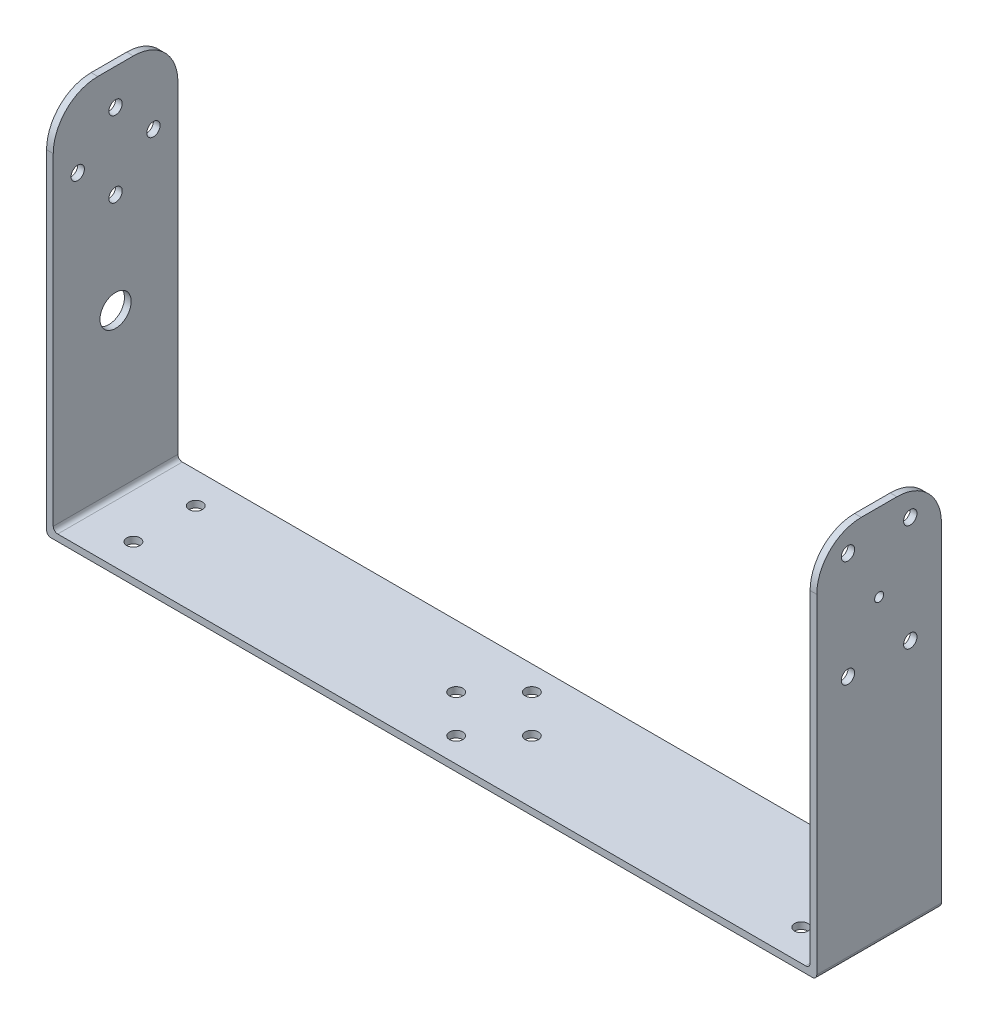
ISO-10303-21;
HEADER;
FILE_DESCRIPTION(('STEP AP214'),'2;1');
FILE_NAME('part.step','',(''),(''),'','','');
FILE_SCHEMA(('AUTOMOTIVE_DESIGN { 1 0 10303 214 1 1 1 1 }'));
ENDSEC;
DATA;
#1=APPLICATION_CONTEXT('core data for automotive mechanical design processes');
#2=APPLICATION_PROTOCOL_DEFINITION('international standard','automotive_design',2000,#1);
#3=PRODUCT_CONTEXT('',#1,'mechanical');
#4=PRODUCT('Part','Part','',(#3));
#5=PRODUCT_RELATED_PRODUCT_CATEGORY('part','',(#4));
#6=PRODUCT_DEFINITION_FORMATION('','',#4);
#7=PRODUCT_DEFINITION_CONTEXT('part definition',#1,'design');
#8=PRODUCT_DEFINITION('design','',#6,#7);
#9=PRODUCT_DEFINITION_SHAPE('','',#8);
#10=(LENGTH_UNIT() NAMED_UNIT(*) SI_UNIT(.MILLI.,.METRE.));
#11=(NAMED_UNIT(*) PLANE_ANGLE_UNIT() SI_UNIT($,.RADIAN.));
#12=(NAMED_UNIT(*) SI_UNIT($,.STERADIAN.) SOLID_ANGLE_UNIT());
#13=UNCERTAINTY_MEASURE_WITH_UNIT(LENGTH_MEASURE(1.E-05),#10,'distance_accuracy_value','');
#14=(GEOMETRIC_REPRESENTATION_CONTEXT(3) GLOBAL_UNCERTAINTY_ASSIGNED_CONTEXT((#13)) GLOBAL_UNIT_ASSIGNED_CONTEXT((#10,
#11,#12)) REPRESENTATION_CONTEXT('',''));
#15=CARTESIAN_POINT('',(0.,0.,0.));
#16=DIRECTION('',(0.,0.,1.));
#17=DIRECTION('',(1.,0.,0.));
#18=AXIS2_PLACEMENT_3D('',#15,#16,#17);
#19=CARTESIAN_POINT('',(0.,1.5,0.));
#20=DIRECTION('',(0.,-1.,0.));
#21=DIRECTION('',(0.,0.,-1.));
#22=AXIS2_PLACEMENT_3D('',#19,#20,#21);
#23=PLANE('',#22);
#24=CARTESIAN_POINT('',(93.5,1.5,-14.));
#25=DIRECTION('',(0.,-1.,0.));
#26=DIRECTION('',(0.,0.,-1.));
#27=AXIS2_PLACEMENT_3D('',#24,#25,#26);
#28=CIRCLE('',#27,1.5);
#29=CARTESIAN_POINT('',(93.5,1.5,-15.5));
#30=VERTEX_POINT('',#29);
#31=EDGE_CURVE('E302',#30,#30,#28,.F.);
#32=ORIENTED_EDGE('',*,*,#31,.F.);
#33=EDGE_LOOP('',(#32));
#34=FACE_BOUND('',#33,.T.);
#35=CARTESIAN_POINT('',(85.,1.5,-22.5));
#36=DIRECTION('',(0.,-1.,0.));
#37=DIRECTION('',(0.,0.,-1.));
#38=AXIS2_PLACEMENT_3D('',#35,#36,#37);
#39=CIRCLE('',#38,1.5);
#40=CARTESIAN_POINT('',(85.,1.5,-24.));
#41=VERTEX_POINT('',#40);
#42=EDGE_CURVE('E295',#41,#41,#39,.F.);
#43=ORIENTED_EDGE('',*,*,#42,.F.);
#44=EDGE_LOOP('',(#43));
#45=FACE_BOUND('',#44,.T.);
#46=CARTESIAN_POINT('',(11.,1.5,-7.));
#47=DIRECTION('',(0.,-1.,0.));
#48=DIRECTION('',(0.,0.,-1.));
#49=AXIS2_PLACEMENT_3D('',#46,#47,#48);
#50=CIRCLE('',#49,1.5);
#51=CARTESIAN_POINT('',(11.,1.5,-8.5));
#52=VERTEX_POINT('',#51);
#53=EDGE_CURVE('E244',#52,#52,#50,.F.);
#54=ORIENTED_EDGE('',*,*,#53,.F.);
#55=EDGE_LOOP('',(#54));
#56=FACE_BOUND('',#55,.T.);
#57=CARTESIAN_POINT('',(161.,1.5,-7.));
#58=DIRECTION('',(0.,-1.,0.));
#59=DIRECTION('',(0.,0.,-1.));
#60=AXIS2_PLACEMENT_3D('',#57,#58,#59);
#61=CIRCLE('',#60,1.5);
#62=CARTESIAN_POINT('',(161.,1.5,-8.5));
#63=VERTEX_POINT('',#62);
#64=EDGE_CURVE('E236',#63,#63,#61,.F.);
#65=ORIENTED_EDGE('',*,*,#64,.F.);
#66=EDGE_LOOP('',(#65));
#67=FACE_BOUND('',#66,.T.);
#68=DIRECTION('',(1.,0.,0.));
#69=VECTOR('',#68,1.);
#70=CARTESIAN_POINT('',(0.,1.5,0.));
#71=LINE('',#70,#69);
#72=CARTESIAN_POINT('',(1.,1.5,0.));
#73=VERTEX_POINT('',#72);
#74=CARTESIAN_POINT('',(169.,1.5,0.));
#75=VERTEX_POINT('',#74);
#76=EDGE_CURVE('E178',#73,#75,#71,.T.);
#77=ORIENTED_EDGE('',*,*,#76,.T.);
#78=DIRECTION('',(0.,0.,-1.));
#79=VECTOR('',#78,1.);
#80=CARTESIAN_POINT('',(169.,1.5,-28.));
#81=LINE('',#80,#79);
#82=CARTESIAN_POINT('',(169.,1.5,-28.));
#83=VERTEX_POINT('',#82);
#84=EDGE_CURVE('E343',#75,#83,#81,.T.);
#85=ORIENTED_EDGE('',*,*,#84,.T.);
#86=DIRECTION('',(-1.,0.,0.));
#87=VECTOR('',#86,1.);
#88=CARTESIAN_POINT('',(0.,1.5,-28.));
#89=LINE('',#88,#87);
#90=CARTESIAN_POINT('',(1.,1.5,-28.));
#91=VERTEX_POINT('',#90);
#92=EDGE_CURVE('E175',#83,#91,#89,.T.);
#93=ORIENTED_EDGE('',*,*,#92,.T.);
#94=DIRECTION('',(0.,0.,1.));
#95=VECTOR('',#94,1.);
#96=CARTESIAN_POINT('',(1.,1.5,0.));
#97=LINE('',#96,#95);
#98=EDGE_CURVE('E204',#91,#73,#97,.T.);
#99=ORIENTED_EDGE('',*,*,#98,.T.);
#100=EDGE_LOOP('',(#77,#85,#93,#99));
#101=FACE_BOUND('',#100,.T.);
#102=CARTESIAN_POINT('',(11.,1.5,-21.));
#103=DIRECTION('',(0.,-1.,0.));
#104=DIRECTION('',(0.,0.,-1.));
#105=AXIS2_PLACEMENT_3D('',#102,#103,#104);
#106=CIRCLE('',#105,1.5);
#107=CARTESIAN_POINT('',(11.,1.5,-22.5));
#108=VERTEX_POINT('',#107);
#109=EDGE_CURVE('E240',#108,#108,#106,.F.);
#110=ORIENTED_EDGE('',*,*,#109,.F.);
#111=EDGE_LOOP('',(#110));
#112=FACE_BOUND('',#111,.T.);
#113=CARTESIAN_POINT('',(161.,1.5,-21.));
#114=DIRECTION('',(0.,-1.,0.));
#115=DIRECTION('',(0.,0.,-1.));
#116=AXIS2_PLACEMENT_3D('',#113,#114,#115);
#117=CIRCLE('',#116,1.5);
#118=CARTESIAN_POINT('',(161.,1.5,-22.5));
#119=VERTEX_POINT('',#118);
#120=EDGE_CURVE('E248',#119,#119,#117,.F.);
#121=ORIENTED_EDGE('',*,*,#120,.F.);
#122=EDGE_LOOP('',(#121));
#123=FACE_BOUND('',#122,.T.);
#124=CARTESIAN_POINT('',(85.,1.5,-5.5));
#125=DIRECTION('',(0.,-1.,0.));
#126=DIRECTION('',(0.,0.,-1.));
#127=AXIS2_PLACEMENT_3D('',#124,#125,#126);
#128=CIRCLE('',#127,1.5);
#129=CARTESIAN_POINT('',(85.,1.5,-7.));
#130=VERTEX_POINT('',#129);
#131=EDGE_CURVE('E299',#130,#130,#128,.F.);
#132=ORIENTED_EDGE('',*,*,#131,.F.);
#133=EDGE_LOOP('',(#132));
#134=FACE_BOUND('',#133,.T.);
#135=CARTESIAN_POINT('',(76.5,1.5,-14.));
#136=DIRECTION('',(0.,-1.,0.));
#137=DIRECTION('',(0.,0.,-1.));
#138=AXIS2_PLACEMENT_3D('',#135,#136,#137);
#139=CIRCLE('',#138,1.5);
#140=CARTESIAN_POINT('',(76.5,1.5,-15.5));
#141=VERTEX_POINT('',#140);
#142=EDGE_CURVE('E305',#141,#141,#139,.F.);
#143=ORIENTED_EDGE('',*,*,#142,.F.);
#144=EDGE_LOOP('',(#143));
#145=FACE_BOUND('',#144,.T.);
#146=ADVANCED_FACE('F33',(#34,#45,#56,#67,#101,#112,#123,#134,#145),#23,.F.);
#147=CARTESIAN_POINT('',(0.,0.,0.));
#148=DIRECTION('',(0.,-1.,0.));
#149=DIRECTION('',(0.,0.,-1.));
#150=AXIS2_PLACEMENT_3D('',#147,#148,#149);
#151=PLANE('',#150);
#152=CARTESIAN_POINT('',(93.5,0.,-14.));
#153=DIRECTION('',(0.,-1.,0.));
#154=DIRECTION('',(0.,0.,-1.));
#155=AXIS2_PLACEMENT_3D('',#152,#153,#154);
#156=CIRCLE('',#155,1.5);
#157=CARTESIAN_POINT('',(93.5,0.,-15.5));
#158=VERTEX_POINT('',#157);
#159=EDGE_CURVE('E303',#158,#158,#156,.F.);
#160=ORIENTED_EDGE('',*,*,#159,.T.);
#161=EDGE_LOOP('',(#160));
#162=FACE_BOUND('',#161,.T.);
#163=CARTESIAN_POINT('',(85.,0.,-22.5));
#164=DIRECTION('',(0.,-1.,0.));
#165=DIRECTION('',(0.,0.,-1.));
#166=AXIS2_PLACEMENT_3D('',#163,#164,#165);
#167=CIRCLE('',#166,1.5);
#168=CARTESIAN_POINT('',(85.,0.,-24.));
#169=VERTEX_POINT('',#168);
#170=EDGE_CURVE('E296',#169,#169,#167,.F.);
#171=ORIENTED_EDGE('',*,*,#170,.T.);
#172=EDGE_LOOP('',(#171));
#173=FACE_BOUND('',#172,.T.);
#174=CARTESIAN_POINT('',(11.,0.,-7.));
#175=DIRECTION('',(0.,-1.,0.));
#176=DIRECTION('',(0.,0.,-1.));
#177=AXIS2_PLACEMENT_3D('',#174,#175,#176);
#178=CIRCLE('',#177,1.5);
#179=CARTESIAN_POINT('',(11.,0.,-8.5));
#180=VERTEX_POINT('',#179);
#181=EDGE_CURVE('E247',#180,#180,#178,.F.);
#182=ORIENTED_EDGE('',*,*,#181,.T.);
#183=EDGE_LOOP('',(#182));
#184=FACE_BOUND('',#183,.T.);
#185=CARTESIAN_POINT('',(161.,0.,-7.));
#186=DIRECTION('',(0.,-1.,0.));
#187=DIRECTION('',(0.,0.,-1.));
#188=AXIS2_PLACEMENT_3D('',#185,#186,#187);
#189=CIRCLE('',#188,1.5);
#190=CARTESIAN_POINT('',(161.,0.,-8.5));
#191=VERTEX_POINT('',#190);
#192=EDGE_CURVE('E239',#191,#191,#189,.F.);
#193=ORIENTED_EDGE('',*,*,#192,.T.);
#194=EDGE_LOOP('',(#193));
#195=FACE_BOUND('',#194,.T.);
#196=DIRECTION('',(-1.,0.,0.));
#197=VECTOR('',#196,1.);
#198=CARTESIAN_POINT('',(0.,0.,-28.));
#199=LINE('',#198,#197);
#200=CARTESIAN_POINT('',(170.5,0.,-28.));
#201=VERTEX_POINT('',#200);
#202=CARTESIAN_POINT('',(-0.5,0.,-28.));
#203=VERTEX_POINT('',#202);
#204=EDGE_CURVE('E195',#201,#203,#199,.T.);
#205=ORIENTED_EDGE('',*,*,#204,.F.);
#206=DIRECTION('',(0.,0.,-1.));
#207=VECTOR('',#206,1.);
#208=CARTESIAN_POINT('',(170.5,0.,0.));
#209=LINE('',#208,#207);
#210=CARTESIAN_POINT('',(170.5,0.,0.));
#211=VERTEX_POINT('',#210);
#212=EDGE_CURVE('E355',#201,#211,#209,.F.);
#213=ORIENTED_EDGE('',*,*,#212,.T.);
#214=DIRECTION('',(1.,0.,0.));
#215=VECTOR('',#214,1.);
#216=CARTESIAN_POINT('',(0.,0.,0.));
#217=LINE('',#216,#215);
#218=CARTESIAN_POINT('',(-0.5,0.,0.));
#219=VERTEX_POINT('',#218);
#220=EDGE_CURVE('E192',#219,#211,#217,.T.);
#221=ORIENTED_EDGE('',*,*,#220,.F.);
#222=DIRECTION('',(0.,0.,-1.));
#223=VECTOR('',#222,1.);
#224=CARTESIAN_POINT('',(-0.5,0.,-28.));
#225=LINE('',#224,#223);
#226=EDGE_CURVE('E377',#219,#203,#225,.T.);
#227=ORIENTED_EDGE('',*,*,#226,.T.);
#228=EDGE_LOOP('',(#205,#213,#221,#227));
#229=FACE_BOUND('',#228,.T.);
#230=CARTESIAN_POINT('',(11.,0.,-21.));
#231=DIRECTION('',(0.,-1.,0.));
#232=DIRECTION('',(0.,0.,-1.));
#233=AXIS2_PLACEMENT_3D('',#230,#231,#232);
#234=CIRCLE('',#233,1.5);
#235=CARTESIAN_POINT('',(11.,0.,-22.5));
#236=VERTEX_POINT('',#235);
#237=EDGE_CURVE('E243',#236,#236,#234,.F.);
#238=ORIENTED_EDGE('',*,*,#237,.T.);
#239=EDGE_LOOP('',(#238));
#240=FACE_BOUND('',#239,.T.);
#241=CARTESIAN_POINT('',(161.,0.,-21.));
#242=DIRECTION('',(0.,-1.,0.));
#243=DIRECTION('',(0.,0.,-1.));
#244=AXIS2_PLACEMENT_3D('',#241,#242,#243);
#245=CIRCLE('',#244,1.5);
#246=CARTESIAN_POINT('',(161.,0.,-22.5));
#247=VERTEX_POINT('',#246);
#248=EDGE_CURVE('E251',#247,#247,#245,.F.);
#249=ORIENTED_EDGE('',*,*,#248,.T.);
#250=EDGE_LOOP('',(#249));
#251=FACE_BOUND('',#250,.T.);
#252=CARTESIAN_POINT('',(85.,0.,-5.5));
#253=DIRECTION('',(0.,-1.,0.));
#254=DIRECTION('',(0.,0.,-1.));
#255=AXIS2_PLACEMENT_3D('',#252,#253,#254);
#256=CIRCLE('',#255,1.5);
#257=CARTESIAN_POINT('',(85.,0.,-7.));
#258=VERTEX_POINT('',#257);
#259=EDGE_CURVE('E300',#258,#258,#256,.F.);
#260=ORIENTED_EDGE('',*,*,#259,.T.);
#261=EDGE_LOOP('',(#260));
#262=FACE_BOUND('',#261,.T.);
#263=CARTESIAN_POINT('',(76.5,0.,-14.));
#264=DIRECTION('',(0.,-1.,0.));
#265=DIRECTION('',(0.,0.,-1.));
#266=AXIS2_PLACEMENT_3D('',#263,#264,#265);
#267=CIRCLE('',#266,1.5);
#268=CARTESIAN_POINT('',(76.5,0.,-15.5));
#269=VERTEX_POINT('',#268);
#270=EDGE_CURVE('E37',#269,#269,#267,.F.);
#271=ORIENTED_EDGE('',*,*,#270,.T.);
#272=EDGE_LOOP('',(#271));
#273=FACE_BOUND('',#272,.T.);
#274=ADVANCED_FACE('F374',(#162,#173,#184,#195,#229,#240,#251,#262,#273),#151,.T.);
#275=CARTESIAN_POINT('',(171.5,0.,0.));
#276=DIRECTION('',(1.,0.,0.));
#277=DIRECTION('',(0.,0.,-1.));
#278=AXIS2_PLACEMENT_3D('',#275,#276,#277);
#279=PLANE('',#278);
#280=CARTESIAN_POINT('',(171.5,55.5,-7.));
#281=DIRECTION('',(1.,0.,0.));
#282=DIRECTION('',(0.,0.,-1.));
#283=AXIS2_PLACEMENT_3D('',#280,#281,#282);
#284=CIRCLE('',#283,1.5);
#285=CARTESIAN_POINT('',(171.5,55.5,-8.5));
#286=VERTEX_POINT('',#285);
#287=EDGE_CURVE('E287',#286,#286,#284,.F.);
#288=ORIENTED_EDGE('',*,*,#287,.T.);
#289=EDGE_LOOP('',(#288));
#290=FACE_BOUND('',#289,.T.);
#291=CARTESIAN_POINT('',(171.5,79.5,-21.));
#292=DIRECTION('',(1.,0.,0.));
#293=DIRECTION('',(0.,0.,-1.));
#294=AXIS2_PLACEMENT_3D('',#291,#292,#293);
#295=CIRCLE('',#294,1.5);
#296=CARTESIAN_POINT('',(171.5,79.5,-22.5));
#297=VERTEX_POINT('',#296);
#298=EDGE_CURVE('E282',#297,#297,#295,.F.);
#299=ORIENTED_EDGE('',*,*,#298,.T.);
#300=EDGE_LOOP('',(#299));
#301=FACE_BOUND('',#300,.T.);
#302=DIRECTION('',(0.,1.,0.));
#303=VECTOR('',#302,1.);
#304=CARTESIAN_POINT('',(171.5,0.,-28.));
#305=LINE('',#304,#303);
#306=CARTESIAN_POINT('',(171.5,1.,-28.));
#307=VERTEX_POINT('',#306);
#308=CARTESIAN_POINT('',(171.5,75.,-28.));
#309=VERTEX_POINT('',#308);
#310=EDGE_CURVE('E260',#307,#309,#305,.T.);
#311=ORIENTED_EDGE('',*,*,#310,.T.);
#312=CARTESIAN_POINT('',(171.5,75.,-18.));
#313=DIRECTION('',(1.,0.,0.));
#314=DIRECTION('',(0.,0.,-1.));
#315=AXIS2_PLACEMENT_3D('',#312,#313,#314);
#316=CIRCLE('',#315,10.);
#317=CARTESIAN_POINT('',(171.5,85.,-18.));
#318=VERTEX_POINT('',#317);
#319=EDGE_CURVE('E11',#309,#318,#316,.T.);
#320=ORIENTED_EDGE('',*,*,#319,.T.);
#321=DIRECTION('',(0.,0.,1.));
#322=VECTOR('',#321,1.);
#323=CARTESIAN_POINT('',(171.5,85.,-28.));
#324=LINE('',#323,#322);
#325=CARTESIAN_POINT('',(171.5,85.,-10.));
#326=VERTEX_POINT('',#325);
#327=EDGE_CURVE('E336',#318,#326,#324,.T.);
#328=ORIENTED_EDGE('',*,*,#327,.T.);
#329=CARTESIAN_POINT('',(171.5,75.,-10.));
#330=DIRECTION('',(1.,0.,0.));
#331=DIRECTION('',(0.,0.,-1.));
#332=AXIS2_PLACEMENT_3D('',#329,#330,#331);
#333=CIRCLE('',#332,10.);
#334=CARTESIAN_POINT('',(171.5,75.,0.));
#335=VERTEX_POINT('',#334);
#336=EDGE_CURVE('E272',#326,#335,#333,.T.);
#337=ORIENTED_EDGE('',*,*,#336,.T.);
#338=DIRECTION('',(0.,-1.,0.));
#339=VECTOR('',#338,1.);
#340=CARTESIAN_POINT('',(171.5,0.,0.));
#341=LINE('',#340,#339);
#342=CARTESIAN_POINT('',(171.5,1.,0.));
#343=VERTEX_POINT('',#342);
#344=EDGE_CURVE('E338',#335,#343,#341,.T.);
#345=ORIENTED_EDGE('',*,*,#344,.T.);
#346=DIRECTION('',(0.,0.,-1.));
#347=VECTOR('',#346,1.);
#348=CARTESIAN_POINT('',(171.5,1.,0.));
#349=LINE('',#348,#347);
#350=EDGE_CURVE('E351',#343,#307,#349,.T.);
#351=ORIENTED_EDGE('',*,*,#350,.T.);
#352=EDGE_LOOP('',(#311,#320,#328,#337,#345,#351));
#353=FACE_BOUND('',#352,.T.);
#354=CARTESIAN_POINT('',(171.5,67.5,-14.));
#355=DIRECTION('',(1.,0.,0.));
#356=DIRECTION('',(0.,0.,-1.));
#357=AXIS2_PLACEMENT_3D('',#354,#355,#356);
#358=CIRCLE('',#357,1.);
#359=CARTESIAN_POINT('',(171.5,67.5,-15.));
#360=VERTEX_POINT('',#359);
#361=EDGE_CURVE('E329',#360,#360,#358,.T.);
#362=ORIENTED_EDGE('',*,*,#361,.F.);
#363=EDGE_LOOP('',(#362));
#364=FACE_BOUND('',#363,.T.);
#365=CARTESIAN_POINT('',(171.5,79.5,-7.));
#366=DIRECTION('',(1.,0.,0.));
#367=DIRECTION('',(0.,0.,-1.));
#368=AXIS2_PLACEMENT_3D('',#365,#366,#367);
#369=CIRCLE('',#368,1.5);
#370=CARTESIAN_POINT('',(171.5,79.5,-8.5));
#371=VERTEX_POINT('',#370);
#372=EDGE_CURVE('E283',#371,#371,#369,.F.);
#373=ORIENTED_EDGE('',*,*,#372,.T.);
#374=EDGE_LOOP('',(#373));
#375=FACE_BOUND('',#374,.T.);
#376=CARTESIAN_POINT('',(171.5,55.5,-21.));
#377=DIRECTION('',(1.,0.,0.));
#378=DIRECTION('',(0.,0.,-1.));
#379=AXIS2_PLACEMENT_3D('',#376,#377,#378);
#380=CIRCLE('',#379,1.5);
#381=CARTESIAN_POINT('',(171.5,55.5,-22.5));
#382=VERTEX_POINT('',#381);
#383=EDGE_CURVE('E291',#382,#382,#380,.F.);
#384=ORIENTED_EDGE('',*,*,#383,.T.);
#385=EDGE_LOOP('',(#384));
#386=FACE_BOUND('',#385,.T.);
#387=ADVANCED_FACE('F370',(#290,#301,#353,#364,#375,#386),#279,.T.);
#388=CARTESIAN_POINT('',(170.,0.,0.));
#389=DIRECTION('',(1.,0.,0.));
#390=DIRECTION('',(0.,0.,-1.));
#391=AXIS2_PLACEMENT_3D('',#388,#389,#390);
#392=PLANE('',#391);
#393=CARTESIAN_POINT('',(170.,55.5,-7.));
#394=DIRECTION('',(1.,0.,0.));
#395=DIRECTION('',(0.,0.,-1.));
#396=AXIS2_PLACEMENT_3D('',#393,#394,#395);
#397=CIRCLE('',#396,1.5);
#398=CARTESIAN_POINT('',(170.,55.5,-8.5));
#399=VERTEX_POINT('',#398);
#400=EDGE_CURVE('E288',#399,#399,#397,.F.);
#401=ORIENTED_EDGE('',*,*,#400,.F.);
#402=EDGE_LOOP('',(#401));
#403=FACE_BOUND('',#402,.T.);
#404=CARTESIAN_POINT('',(170.,79.5,-21.));
#405=DIRECTION('',(1.,0.,0.));
#406=DIRECTION('',(0.,0.,-1.));
#407=AXIS2_PLACEMENT_3D('',#404,#405,#406);
#408=CIRCLE('',#407,1.5);
#409=CARTESIAN_POINT('',(170.,79.5,-22.5));
#410=VERTEX_POINT('',#409);
#411=EDGE_CURVE('E279',#410,#410,#408,.F.);
#412=ORIENTED_EDGE('',*,*,#411,.F.);
#413=EDGE_LOOP('',(#412));
#414=FACE_BOUND('',#413,.T.);
#415=DIRECTION('',(0.,0.,1.));
#416=VECTOR('',#415,1.);
#417=CARTESIAN_POINT('',(170.,85.,-28.));
#418=LINE('',#417,#416);
#419=CARTESIAN_POINT('',(170.,85.,-18.));
#420=VERTEX_POINT('',#419);
#421=CARTESIAN_POINT('',(170.,85.,-10.));
#422=VERTEX_POINT('',#421);
#423=EDGE_CURVE('E254',#420,#422,#418,.T.);
#424=ORIENTED_EDGE('',*,*,#423,.F.);
#425=CARTESIAN_POINT('',(170.,75.,-18.));
#426=DIRECTION('',(1.,0.,0.));
#427=DIRECTION('',(0.,0.,-1.));
#428=AXIS2_PLACEMENT_3D('',#425,#426,#427);
#429=CIRCLE('',#428,10.);
#430=CARTESIAN_POINT('',(170.,75.,-28.));
#431=VERTEX_POINT('',#430);
#432=EDGE_CURVE('E57',#420,#431,#429,.F.);
#433=ORIENTED_EDGE('',*,*,#432,.T.);
#434=DIRECTION('',(0.,1.,0.));
#435=VECTOR('',#434,1.);
#436=CARTESIAN_POINT('',(170.,0.,-28.));
#437=LINE('',#436,#435);
#438=CARTESIAN_POINT('',(170.,2.5,-28.));
#439=VERTEX_POINT('',#438);
#440=EDGE_CURVE('E332',#439,#431,#437,.T.);
#441=ORIENTED_EDGE('',*,*,#440,.F.);
#442=DIRECTION('',(0.,0.,-1.));
#443=VECTOR('',#442,1.);
#444=CARTESIAN_POINT('',(170.,2.5,0.));
#445=LINE('',#444,#443);
#446=CARTESIAN_POINT('',(170.,2.5,0.));
#447=VERTEX_POINT('',#446);
#448=EDGE_CURVE('E344',#439,#447,#445,.F.);
#449=ORIENTED_EDGE('',*,*,#448,.T.);
#450=DIRECTION('',(0.,-1.,0.));
#451=VECTOR('',#450,1.);
#452=CARTESIAN_POINT('',(170.,0.,0.));
#453=LINE('',#452,#451);
#454=CARTESIAN_POINT('',(170.,75.,0.));
#455=VERTEX_POINT('',#454);
#456=EDGE_CURVE('E257',#455,#447,#453,.T.);
#457=ORIENTED_EDGE('',*,*,#456,.F.);
#458=CARTESIAN_POINT('',(170.,75.,-10.));
#459=DIRECTION('',(1.,0.,0.));
#460=DIRECTION('',(0.,0.,-1.));
#461=AXIS2_PLACEMENT_3D('',#458,#459,#460);
#462=CIRCLE('',#461,10.);
#463=EDGE_CURVE('E266',#455,#422,#462,.F.);
#464=ORIENTED_EDGE('',*,*,#463,.T.);
#465=EDGE_LOOP('',(#424,#433,#441,#449,#457,#464));
#466=FACE_BOUND('',#465,.T.);
#467=CARTESIAN_POINT('',(170.,67.5,-14.));
#468=DIRECTION('',(1.,0.,0.));
#469=DIRECTION('',(0.,0.,-1.));
#470=AXIS2_PLACEMENT_3D('',#467,#468,#469);
#471=CIRCLE('',#470,1.);
#472=CARTESIAN_POINT('',(170.,67.5,-15.));
#473=VERTEX_POINT('',#472);
#474=EDGE_CURVE('E328',#473,#473,#471,.T.);
#475=ORIENTED_EDGE('',*,*,#474,.T.);
#476=EDGE_LOOP('',(#475));
#477=FACE_BOUND('',#476,.T.);
#478=CARTESIAN_POINT('',(170.,79.5,-7.));
#479=DIRECTION('',(1.,0.,0.));
#480=DIRECTION('',(0.,0.,-1.));
#481=AXIS2_PLACEMENT_3D('',#478,#479,#480);
#482=CIRCLE('',#481,1.5);
#483=CARTESIAN_POINT('',(170.,79.5,-8.5));
#484=VERTEX_POINT('',#483);
#485=EDGE_CURVE('E284',#484,#484,#482,.F.);
#486=ORIENTED_EDGE('',*,*,#485,.F.);
#487=EDGE_LOOP('',(#486));
#488=FACE_BOUND('',#487,.T.);
#489=CARTESIAN_POINT('',(170.,55.5,-21.));
#490=DIRECTION('',(1.,0.,0.));
#491=DIRECTION('',(0.,0.,-1.));
#492=AXIS2_PLACEMENT_3D('',#489,#490,#491);
#493=CIRCLE('',#492,1.5);
#494=CARTESIAN_POINT('',(170.,55.5,-22.5));
#495=VERTEX_POINT('',#494);
#496=EDGE_CURVE('E292',#495,#495,#493,.F.);
#497=ORIENTED_EDGE('',*,*,#496,.F.);
#498=EDGE_LOOP('',(#497));
#499=FACE_BOUND('',#498,.T.);
#500=ADVANCED_FACE('F520',(#403,#414,#466,#477,#488,#499),#392,.F.);
#501=CARTESIAN_POINT('',(0.,0.,0.));
#502=DIRECTION('',(1.,0.,0.));
#503=DIRECTION('',(0.,0.,-1.));
#504=AXIS2_PLACEMENT_3D('',#501,#502,#503);
#505=PLANE('',#504);
#506=CARTESIAN_POINT('',(0.,68.5,-5.5));
#507=DIRECTION('',(1.,0.,0.));
#508=DIRECTION('',(0.,0.,-1.));
#509=AXIS2_PLACEMENT_3D('',#506,#507,#508);
#510=CIRCLE('',#509,1.5);
#511=CARTESIAN_POINT('',(0.,68.5,-7.));
#512=VERTEX_POINT('',#511);
#513=EDGE_CURVE('E228',#512,#512,#510,.F.);
#514=ORIENTED_EDGE('',*,*,#513,.T.);
#515=EDGE_LOOP('',(#514));
#516=FACE_BOUND('',#515,.T.);
#517=CARTESIAN_POINT('',(0.,60.,-14.));
#518=DIRECTION('',(1.,0.,0.));
#519=DIRECTION('',(0.,0.,-1.));
#520=AXIS2_PLACEMENT_3D('',#517,#518,#519);
#521=CIRCLE('',#520,1.5);
#522=CARTESIAN_POINT('',(0.,60.,-15.5));
#523=VERTEX_POINT('',#522);
#524=EDGE_CURVE('E220',#523,#523,#521,.F.);
#525=ORIENTED_EDGE('',*,*,#524,.T.);
#526=EDGE_LOOP('',(#525));
#527=FACE_BOUND('',#526,.T.);
#528=DIRECTION('',(0.,-1.,0.));
#529=VECTOR('',#528,1.);
#530=CARTESIAN_POINT('',(0.,0.,0.));
#531=LINE('',#530,#529);
#532=CARTESIAN_POINT('',(0.,75.,0.));
#533=VERTEX_POINT('',#532);
#534=CARTESIAN_POINT('',(0.,2.5,0.));
#535=VERTEX_POINT('',#534);
#536=EDGE_CURVE('E158',#533,#535,#531,.T.);
#537=ORIENTED_EDGE('',*,*,#536,.T.);
#538=DIRECTION('',(0.,0.,1.));
#539=VECTOR('',#538,1.);
#540=CARTESIAN_POINT('',(0.,2.5,0.));
#541=LINE('',#540,#539);
#542=CARTESIAN_POINT('',(0.,2.5,-28.));
#543=VERTEX_POINT('',#542);
#544=EDGE_CURVE('E207',#535,#543,#541,.F.);
#545=ORIENTED_EDGE('',*,*,#544,.T.);
#546=DIRECTION('',(0.,1.,0.));
#547=VECTOR('',#546,1.);
#548=CARTESIAN_POINT('',(0.,0.,-28.));
#549=LINE('',#548,#547);
#550=CARTESIAN_POINT('',(0.,75.,-28.));
#551=VERTEX_POINT('',#550);
#552=EDGE_CURVE('E208',#543,#551,#549,.T.);
#553=ORIENTED_EDGE('',*,*,#552,.T.);
#554=CARTESIAN_POINT('',(0.,75.,-18.));
#555=DIRECTION('',(1.,0.,0.));
#556=DIRECTION('',(0.,0.,-1.));
#557=AXIS2_PLACEMENT_3D('',#554,#555,#556);
#558=CIRCLE('',#557,10.);
#559=CARTESIAN_POINT('',(0.,85.,-18.));
#560=VERTEX_POINT('',#559);
#561=EDGE_CURVE('E173',#551,#560,#558,.T.);
#562=ORIENTED_EDGE('',*,*,#561,.T.);
#563=DIRECTION('',(0.,0.,1.));
#564=VECTOR('',#563,1.);
#565=CARTESIAN_POINT('',(0.,85.,-28.));
#566=LINE('',#565,#564);
#567=CARTESIAN_POINT('',(0.,85.,-10.));
#568=VERTEX_POINT('',#567);
#569=EDGE_CURVE('E186',#560,#568,#566,.T.);
#570=ORIENTED_EDGE('',*,*,#569,.T.);
#571=CARTESIAN_POINT('',(0.,75.,-10.));
#572=DIRECTION('',(1.,0.,0.));
#573=DIRECTION('',(0.,0.,-1.));
#574=AXIS2_PLACEMENT_3D('',#571,#572,#573);
#575=CIRCLE('',#574,10.);
#576=EDGE_CURVE('E174',#568,#533,#575,.T.);
#577=ORIENTED_EDGE('',*,*,#576,.T.);
#578=EDGE_LOOP('',(#537,#545,#553,#562,#570,#577));
#579=FACE_BOUND('',#578,.T.);
#580=CARTESIAN_POINT('',(0.,77.,-14.));
#581=DIRECTION('',(1.,0.,0.));
#582=DIRECTION('',(0.,0.,-1.));
#583=AXIS2_PLACEMENT_3D('',#580,#581,#582);
#584=CIRCLE('',#583,1.5);
#585=CARTESIAN_POINT('',(0.,77.,-15.5));
#586=VERTEX_POINT('',#585);
#587=EDGE_CURVE('E210',#586,#586,#584,.F.);
#588=ORIENTED_EDGE('',*,*,#587,.T.);
#589=EDGE_LOOP('',(#588));
#590=FACE_BOUND('',#589,.T.);
#591=CARTESIAN_POINT('',(0.,68.5,-22.5));
#592=DIRECTION('',(1.,0.,0.));
#593=DIRECTION('',(0.,0.,-1.));
#594=AXIS2_PLACEMENT_3D('',#591,#592,#593);
#595=CIRCLE('',#594,1.5);
#596=CARTESIAN_POINT('',(0.,68.5,-24.));
#597=VERTEX_POINT('',#596);
#598=EDGE_CURVE('E224',#597,#597,#595,.F.);
#599=ORIENTED_EDGE('',*,*,#598,.T.);
#600=EDGE_LOOP('',(#599));
#601=FACE_BOUND('',#600,.T.);
#602=CARTESIAN_POINT('',(0.,37.5,-14.));
#603=DIRECTION('',(1.,0.,0.));
#604=DIRECTION('',(0.,0.,-1.));
#605=AXIS2_PLACEMENT_3D('',#602,#603,#604);
#606=CIRCLE('',#605,3.5);
#607=CARTESIAN_POINT('',(0.,37.5,-17.5));
#608=VERTEX_POINT('',#607);
#609=EDGE_CURVE('E232',#608,#608,#606,.F.);
#610=ORIENTED_EDGE('',*,*,#609,.T.);
#611=EDGE_LOOP('',(#610));
#612=FACE_BOUND('',#611,.T.);
#613=ADVANCED_FACE('F434',(#516,#527,#579,#590,#601,#612),#505,.T.);
#614=CARTESIAN_POINT('',(-1.5,0.,0.));
#615=DIRECTION('',(1.,0.,0.));
#616=DIRECTION('',(0.,0.,-1.));
#617=AXIS2_PLACEMENT_3D('',#614,#615,#616);
#618=PLANE('',#617);
#619=CARTESIAN_POINT('',(-1.5,68.5,-5.5));
#620=DIRECTION('',(1.,0.,0.));
#621=DIRECTION('',(0.,0.,-1.));
#622=AXIS2_PLACEMENT_3D('',#619,#620,#621);
#623=CIRCLE('',#622,1.5);
#624=CARTESIAN_POINT('',(-1.5,68.5,-7.));
#625=VERTEX_POINT('',#624);
#626=EDGE_CURVE('E231',#625,#625,#623,.F.);
#627=ORIENTED_EDGE('',*,*,#626,.F.);
#628=EDGE_LOOP('',(#627));
#629=FACE_BOUND('',#628,.T.);
#630=CARTESIAN_POINT('',(-1.5,60.,-14.));
#631=DIRECTION('',(1.,0.,0.));
#632=DIRECTION('',(0.,0.,-1.));
#633=AXIS2_PLACEMENT_3D('',#630,#631,#632);
#634=CIRCLE('',#633,1.5);
#635=CARTESIAN_POINT('',(-1.5,60.,-15.5));
#636=VERTEX_POINT('',#635);
#637=EDGE_CURVE('E223',#636,#636,#634,.F.);
#638=ORIENTED_EDGE('',*,*,#637,.F.);
#639=EDGE_LOOP('',(#638));
#640=FACE_BOUND('',#639,.T.);
#641=DIRECTION('',(0.,1.,0.));
#642=VECTOR('',#641,1.);
#643=CARTESIAN_POINT('',(-1.5,0.,-28.));
#644=LINE('',#643,#642);
#645=CARTESIAN_POINT('',(-1.5,1.,-28.));
#646=VERTEX_POINT('',#645);
#647=CARTESIAN_POINT('',(-1.5,75.,-28.));
#648=VERTEX_POINT('',#647);
#649=EDGE_CURVE('E147',#646,#648,#644,.T.);
#650=ORIENTED_EDGE('',*,*,#649,.F.);
#651=DIRECTION('',(0.,0.,-1.));
#652=VECTOR('',#651,1.);
#653=CARTESIAN_POINT('',(-1.5,1.,0.));
#654=LINE('',#653,#652);
#655=CARTESIAN_POINT('',(-1.5,1.,0.));
#656=VERTEX_POINT('',#655);
#657=EDGE_CURVE('E381',#646,#656,#654,.F.);
#658=ORIENTED_EDGE('',*,*,#657,.T.);
#659=DIRECTION('',(0.,-1.,0.));
#660=VECTOR('',#659,1.);
#661=CARTESIAN_POINT('',(-1.5,0.,0.));
#662=LINE('',#661,#660);
#663=CARTESIAN_POINT('',(-1.5,75.,0.));
#664=VERTEX_POINT('',#663);
#665=EDGE_CURVE('E196',#664,#656,#662,.T.);
#666=ORIENTED_EDGE('',*,*,#665,.F.);
#667=CARTESIAN_POINT('',(-1.5,75.,-10.));
#668=DIRECTION('',(1.,0.,0.));
#669=DIRECTION('',(0.,0.,-1.));
#670=AXIS2_PLACEMENT_3D('',#667,#668,#669);
#671=CIRCLE('',#670,10.);
#672=CARTESIAN_POINT('',(-1.5,85.,-10.));
#673=VERTEX_POINT('',#672);
#674=EDGE_CURVE('E169',#664,#673,#671,.F.);
#675=ORIENTED_EDGE('',*,*,#674,.T.);
#676=DIRECTION('',(0.,0.,1.));
#677=VECTOR('',#676,1.);
#678=CARTESIAN_POINT('',(-1.5,85.,-28.));
#679=LINE('',#678,#677);
#680=CARTESIAN_POINT('',(-1.5,85.,-18.));
#681=VERTEX_POINT('',#680);
#682=EDGE_CURVE('E157',#681,#673,#679,.T.);
#683=ORIENTED_EDGE('',*,*,#682,.F.);
#684=CARTESIAN_POINT('',(-1.5,75.,-18.));
#685=DIRECTION('',(1.,0.,0.));
#686=DIRECTION('',(0.,0.,-1.));
#687=AXIS2_PLACEMENT_3D('',#684,#685,#686);
#688=CIRCLE('',#687,10.);
#689=EDGE_CURVE('E162',#681,#648,#688,.F.);
#690=ORIENTED_EDGE('',*,*,#689,.T.);
#691=EDGE_LOOP('',(#650,#658,#666,#675,#683,#690));
#692=FACE_BOUND('',#691,.T.);
#693=CARTESIAN_POINT('',(-1.5,77.,-14.));
#694=DIRECTION('',(1.,0.,0.));
#695=DIRECTION('',(0.,0.,-1.));
#696=AXIS2_PLACEMENT_3D('',#693,#694,#695);
#697=CIRCLE('',#696,1.5);
#698=CARTESIAN_POINT('',(-1.5,77.,-15.5));
#699=VERTEX_POINT('',#698);
#700=EDGE_CURVE('E219',#699,#699,#697,.F.);
#701=ORIENTED_EDGE('',*,*,#700,.F.);
#702=EDGE_LOOP('',(#701));
#703=FACE_BOUND('',#702,.T.);
#704=CARTESIAN_POINT('',(-1.5,68.5,-22.5));
#705=DIRECTION('',(1.,0.,0.));
#706=DIRECTION('',(0.,0.,-1.));
#707=AXIS2_PLACEMENT_3D('',#704,#705,#706);
#708=CIRCLE('',#707,1.5);
#709=CARTESIAN_POINT('',(-1.5,68.5,-24.));
#710=VERTEX_POINT('',#709);
#711=EDGE_CURVE('E227',#710,#710,#708,.F.);
#712=ORIENTED_EDGE('',*,*,#711,.F.);
#713=EDGE_LOOP('',(#712));
#714=FACE_BOUND('',#713,.T.);
#715=CARTESIAN_POINT('',(-1.5,37.5,-14.));
#716=DIRECTION('',(1.,0.,0.));
#717=DIRECTION('',(0.,0.,-1.));
#718=AXIS2_PLACEMENT_3D('',#715,#716,#717);
#719=CIRCLE('',#718,3.5);
#720=CARTESIAN_POINT('',(-1.5,37.5,-17.5));
#721=VERTEX_POINT('',#720);
#722=EDGE_CURVE('E235',#721,#721,#719,.F.);
#723=ORIENTED_EDGE('',*,*,#722,.F.);
#724=EDGE_LOOP('',(#723));
#725=FACE_BOUND('',#724,.T.);
#726=ADVANCED_FACE('F163',(#629,#640,#692,#703,#714,#725),#618,.F.);
#727=CARTESIAN_POINT('',(0.,1.5,0.));
#728=DIRECTION('',(0.,0.,-1.));
#729=DIRECTION('',(-1.,0.,0.));
#730=AXIS2_PLACEMENT_3D('',#727,#728,#729);
#731=PLANE('',#730);
#732=ORIENTED_EDGE('',*,*,#344,.F.);
#733=DIRECTION('',(-1.,0.,0.));
#734=VECTOR('',#733,1.);
#735=CARTESIAN_POINT('',(0.,75.,0.));
#736=LINE('',#735,#734);
#737=EDGE_CURVE('E263',#335,#455,#736,.T.);
#738=ORIENTED_EDGE('',*,*,#737,.T.);
#739=ORIENTED_EDGE('',*,*,#456,.T.);
#740=CARTESIAN_POINT('',(169.,2.5,0.));
#741=DIRECTION('',(0.,0.,-1.));
#742=DIRECTION('',(-1.,0.,0.));
#743=AXIS2_PLACEMENT_3D('',#740,#741,#742);
#744=CIRCLE('',#743,1.);
#745=EDGE_CURVE('E349',#447,#75,#744,.T.);
#746=ORIENTED_EDGE('',*,*,#745,.T.);
#747=ORIENTED_EDGE('',*,*,#76,.F.);
#748=CARTESIAN_POINT('',(1.,2.5,0.));
#749=DIRECTION('',(0.,0.,-1.));
#750=DIRECTION('',(-1.,0.,0.));
#751=AXIS2_PLACEMENT_3D('',#748,#749,#750);
#752=CIRCLE('',#751,1.);
#753=EDGE_CURVE('E442',#73,#535,#752,.T.);
#754=ORIENTED_EDGE('',*,*,#753,.T.);
#755=ORIENTED_EDGE('',*,*,#536,.F.);
#756=DIRECTION('',(1.,0.,0.));
#757=VECTOR('',#756,1.);
#758=CARTESIAN_POINT('',(-1.5,75.,0.));
#759=LINE('',#758,#757);
#760=EDGE_CURVE('E168',#533,#664,#759,.F.);
#761=ORIENTED_EDGE('',*,*,#760,.T.);
#762=ORIENTED_EDGE('',*,*,#665,.T.);
#763=CARTESIAN_POINT('',(-0.5,1.,0.));
#764=DIRECTION('',(0.,0.,-1.));
#765=DIRECTION('',(-1.,0.,0.));
#766=AXIS2_PLACEMENT_3D('',#763,#764,#765);
#767=CIRCLE('',#766,1.);
#768=EDGE_CURVE('E202',#656,#219,#767,.F.);
#769=ORIENTED_EDGE('',*,*,#768,.T.);
#770=ORIENTED_EDGE('',*,*,#220,.T.);
#771=CARTESIAN_POINT('',(170.5,1.,0.));
#772=DIRECTION('',(0.,0.,-1.));
#773=DIRECTION('',(-1.,0.,0.));
#774=AXIS2_PLACEMENT_3D('',#771,#772,#773);
#775=CIRCLE('',#774,1.);
#776=EDGE_CURVE('E261',#211,#343,#775,.F.);
#777=ORIENTED_EDGE('',*,*,#776,.T.);
#778=EDGE_LOOP('',(#732,#738,#739,#746,#747,#754,#755,#761,#762,#769,#770,#777));
#779=FACE_BOUND('',#778,.T.);
#780=ADVANCED_FACE('F365',(#779),#731,.F.);
#781=CARTESIAN_POINT('',(0.,1.5,-28.));
#782=DIRECTION('',(0.,0.,1.));
#783=DIRECTION('',(1.,0.,0.));
#784=AXIS2_PLACEMENT_3D('',#781,#782,#783);
#785=PLANE('',#784);
#786=ORIENTED_EDGE('',*,*,#440,.T.);
#787=DIRECTION('',(-1.,0.,0.));
#788=VECTOR('',#787,1.);
#789=CARTESIAN_POINT('',(0.,75.,-28.));
#790=LINE('',#789,#788);
#791=EDGE_CURVE('E42',#431,#309,#790,.F.);
#792=ORIENTED_EDGE('',*,*,#791,.T.);
#793=ORIENTED_EDGE('',*,*,#310,.F.);
#794=CARTESIAN_POINT('',(170.5,1.,-28.));
#795=DIRECTION('',(0.,0.,1.));
#796=DIRECTION('',(1.,0.,0.));
#797=AXIS2_PLACEMENT_3D('',#794,#795,#796);
#798=CIRCLE('',#797,1.);
#799=EDGE_CURVE('E354',#307,#201,#798,.F.);
#800=ORIENTED_EDGE('',*,*,#799,.T.);
#801=ORIENTED_EDGE('',*,*,#204,.T.);
#802=CARTESIAN_POINT('',(-0.5,1.,-28.));
#803=DIRECTION('',(0.,0.,1.));
#804=DIRECTION('',(1.,0.,0.));
#805=AXIS2_PLACEMENT_3D('',#802,#803,#804);
#806=CIRCLE('',#805,1.);
#807=EDGE_CURVE('E154',#203,#646,#806,.F.);
#808=ORIENTED_EDGE('',*,*,#807,.T.);
#809=ORIENTED_EDGE('',*,*,#649,.T.);
#810=DIRECTION('',(1.,0.,0.));
#811=VECTOR('',#810,1.);
#812=CARTESIAN_POINT('',(0.,75.,-28.));
#813=LINE('',#812,#811);
#814=EDGE_CURVE('E152',#648,#551,#813,.T.);
#815=ORIENTED_EDGE('',*,*,#814,.T.);
#816=ORIENTED_EDGE('',*,*,#552,.F.);
#817=CARTESIAN_POINT('',(1.,2.5,-28.));
#818=DIRECTION('',(0.,0.,1.));
#819=DIRECTION('',(1.,0.,0.));
#820=AXIS2_PLACEMENT_3D('',#817,#818,#819);
#821=CIRCLE('',#820,1.);
#822=EDGE_CURVE('E440',#543,#91,#821,.T.);
#823=ORIENTED_EDGE('',*,*,#822,.T.);
#824=ORIENTED_EDGE('',*,*,#92,.F.);
#825=CARTESIAN_POINT('',(169.,2.5,-28.));
#826=DIRECTION('',(0.,0.,1.));
#827=DIRECTION('',(1.,0.,0.));
#828=AXIS2_PLACEMENT_3D('',#825,#826,#827);
#829=CIRCLE('',#828,1.);
#830=EDGE_CURVE('E347',#83,#439,#829,.T.);
#831=ORIENTED_EDGE('',*,*,#830,.T.);
#832=EDGE_LOOP('',(#786,#792,#793,#800,#801,#808,#809,#815,#816,#823,#824,#831));
#833=FACE_BOUND('',#832,.T.);
#834=ADVANCED_FACE('F149',(#833),#785,.F.);
#835=CARTESIAN_POINT('',(-1.5,85.,-28.));
#836=DIRECTION('',(0.,1.,0.));
#837=DIRECTION('',(0.,0.,1.));
#838=AXIS2_PLACEMENT_3D('',#835,#836,#837);
#839=PLANE('',#838);
#840=ORIENTED_EDGE('',*,*,#569,.F.);
#841=DIRECTION('',(1.,0.,0.));
#842=VECTOR('',#841,1.);
#843=CARTESIAN_POINT('',(-1.5,85.,-18.));
#844=LINE('',#843,#842);
#845=EDGE_CURVE('E427',#560,#681,#844,.F.);
#846=ORIENTED_EDGE('',*,*,#845,.T.);
#847=ORIENTED_EDGE('',*,*,#682,.T.);
#848=DIRECTION('',(1.,0.,0.));
#849=VECTOR('',#848,1.);
#850=CARTESIAN_POINT('',(0.,85.,-10.));
#851=LINE('',#850,#849);
#852=EDGE_CURVE('E429',#673,#568,#851,.T.);
#853=ORIENTED_EDGE('',*,*,#852,.T.);
#854=EDGE_LOOP('',(#840,#846,#847,#853));
#855=FACE_BOUND('',#854,.T.);
#856=ADVANCED_FACE('F410',(#855),#839,.T.);
#857=CARTESIAN_POINT('',(0.,75.,-18.));
#858=DIRECTION('',(-1.,0.,0.));
#859=DIRECTION('',(0.,0.,1.));
#860=AXIS2_PLACEMENT_3D('',#857,#858,#859);
#861=CYLINDRICAL_SURFACE('',#860,10.);
#862=ORIENTED_EDGE('',*,*,#689,.F.);
#863=ORIENTED_EDGE('',*,*,#845,.F.);
#864=ORIENTED_EDGE('',*,*,#561,.F.);
#865=ORIENTED_EDGE('',*,*,#814,.F.);
#866=EDGE_LOOP('',(#862,#863,#864,#865));
#867=FACE_BOUND('',#866,.T.);
#868=ADVANCED_FACE('F172',(#867),#861,.T.);
#869=CARTESIAN_POINT('',(-1.5,75.,-10.));
#870=DIRECTION('',(-1.,0.,0.));
#871=DIRECTION('',(0.,0.,1.));
#872=AXIS2_PLACEMENT_3D('',#869,#870,#871);
#873=CYLINDRICAL_SURFACE('',#872,10.);
#874=ORIENTED_EDGE('',*,*,#674,.F.);
#875=ORIENTED_EDGE('',*,*,#760,.F.);
#876=ORIENTED_EDGE('',*,*,#576,.F.);
#877=ORIENTED_EDGE('',*,*,#852,.F.);
#878=EDGE_LOOP('',(#874,#875,#876,#877));
#879=FACE_BOUND('',#878,.T.);
#880=ADVANCED_FACE('F388',(#879),#873,.T.);
#881=CARTESIAN_POINT('',(-0.5,1.,0.));
#882=DIRECTION('',(0.,0.,1.));
#883=DIRECTION('',(1.,0.,0.));
#884=AXIS2_PLACEMENT_3D('',#881,#882,#883);
#885=CYLINDRICAL_SURFACE('',#884,1.);
#886=ORIENTED_EDGE('',*,*,#768,.F.);
#887=ORIENTED_EDGE('',*,*,#657,.F.);
#888=ORIENTED_EDGE('',*,*,#807,.F.);
#889=ORIENTED_EDGE('',*,*,#226,.F.);
#890=EDGE_LOOP('',(#886,#887,#888,#889));
#891=FACE_BOUND('',#890,.T.);
#892=ADVANCED_FACE('F385',(#891),#885,.T.);
#893=CARTESIAN_POINT('',(1.,2.5,0.));
#894=DIRECTION('',(0.,0.,1.));
#895=DIRECTION('',(1.,0.,0.));
#896=AXIS2_PLACEMENT_3D('',#893,#894,#895);
#897=CYLINDRICAL_SURFACE('',#896,1.);
#898=ORIENTED_EDGE('',*,*,#822,.F.);
#899=ORIENTED_EDGE('',*,*,#544,.F.);
#900=ORIENTED_EDGE('',*,*,#753,.F.);
#901=ORIENTED_EDGE('',*,*,#98,.F.);
#902=EDGE_LOOP('',(#898,#899,#900,#901));
#903=FACE_BOUND('',#902,.T.);
#904=ADVANCED_FACE('F387',(#903),#897,.F.);
#905=CARTESIAN_POINT('',(15.,77.,-14.));
#906=DIRECTION('',(-1.,0.,0.));
#907=DIRECTION('',(0.,0.,1.));
#908=AXIS2_PLACEMENT_3D('',#905,#906,#907);
#909=CYLINDRICAL_SURFACE('',#908,1.5);
#910=ORIENTED_EDGE('',*,*,#587,.F.);
#911=EDGE_LOOP('',(#910));
#912=FACE_BOUND('',#911,.T.);
#913=ORIENTED_EDGE('',*,*,#700,.T.);
#914=EDGE_LOOP('',(#913));
#915=FACE_BOUND('',#914,.T.);
#916=ADVANCED_FACE('F394',(#912,#915),#909,.F.);
#917=CARTESIAN_POINT('',(15.,60.,-14.));
#918=DIRECTION('',(-1.,0.,0.));
#919=DIRECTION('',(0.,0.,1.));
#920=AXIS2_PLACEMENT_3D('',#917,#918,#919);
#921=CYLINDRICAL_SURFACE('',#920,1.5);
#922=ORIENTED_EDGE('',*,*,#524,.F.);
#923=EDGE_LOOP('',(#922));
#924=FACE_BOUND('',#923,.T.);
#925=ORIENTED_EDGE('',*,*,#637,.T.);
#926=EDGE_LOOP('',(#925));
#927=FACE_BOUND('',#926,.T.);
#928=ADVANCED_FACE('F550',(#924,#927),#921,.F.);
#929=CARTESIAN_POINT('',(15.,68.5,-22.5));
#930=DIRECTION('',(-1.,0.,0.));
#931=DIRECTION('',(0.,0.,1.));
#932=AXIS2_PLACEMENT_3D('',#929,#930,#931);
#933=CYLINDRICAL_SURFACE('',#932,1.5);
#934=ORIENTED_EDGE('',*,*,#598,.F.);
#935=EDGE_LOOP('',(#934));
#936=FACE_BOUND('',#935,.T.);
#937=ORIENTED_EDGE('',*,*,#711,.T.);
#938=EDGE_LOOP('',(#937));
#939=FACE_BOUND('',#938,.T.);
#940=ADVANCED_FACE('F546',(#936,#939),#933,.F.);
#941=CARTESIAN_POINT('',(15.,68.5,-5.5));
#942=DIRECTION('',(-1.,0.,0.));
#943=DIRECTION('',(0.,0.,1.));
#944=AXIS2_PLACEMENT_3D('',#941,#942,#943);
#945=CYLINDRICAL_SURFACE('',#944,1.5);
#946=ORIENTED_EDGE('',*,*,#513,.F.);
#947=EDGE_LOOP('',(#946));
#948=FACE_BOUND('',#947,.T.);
#949=ORIENTED_EDGE('',*,*,#626,.T.);
#950=EDGE_LOOP('',(#949));
#951=FACE_BOUND('',#950,.T.);
#952=ADVANCED_FACE('F542',(#948,#951),#945,.F.);
#953=CARTESIAN_POINT('',(15.,37.5,-14.));
#954=DIRECTION('',(-1.,0.,0.));
#955=DIRECTION('',(0.,0.,1.));
#956=AXIS2_PLACEMENT_3D('',#953,#954,#955);
#957=CYLINDRICAL_SURFACE('',#956,3.5);
#958=ORIENTED_EDGE('',*,*,#609,.F.);
#959=EDGE_LOOP('',(#958));
#960=FACE_BOUND('',#959,.T.);
#961=ORIENTED_EDGE('',*,*,#722,.T.);
#962=EDGE_LOOP('',(#961));
#963=FACE_BOUND('',#962,.T.);
#964=ADVANCED_FACE('F538',(#960,#963),#957,.F.);
#965=CARTESIAN_POINT('',(161.,16.5,-7.));
#966=DIRECTION('',(0.,-1.,0.));
#967=DIRECTION('',(0.,0.,-1.));
#968=AXIS2_PLACEMENT_3D('',#965,#966,#967);
#969=CYLINDRICAL_SURFACE('',#968,1.5);
#970=ORIENTED_EDGE('',*,*,#192,.F.);
#971=EDGE_LOOP('',(#970));
#972=FACE_BOUND('',#971,.T.);
#973=ORIENTED_EDGE('',*,*,#64,.T.);
#974=EDGE_LOOP('',(#973));
#975=FACE_BOUND('',#974,.T.);
#976=ADVANCED_FACE('F534',(#972,#975),#969,.F.);
#977=CARTESIAN_POINT('',(11.,16.5,-21.));
#978=DIRECTION('',(0.,-1.,0.));
#979=DIRECTION('',(0.,0.,-1.));
#980=AXIS2_PLACEMENT_3D('',#977,#978,#979);
#981=CYLINDRICAL_SURFACE('',#980,1.5);
#982=ORIENTED_EDGE('',*,*,#237,.F.);
#983=EDGE_LOOP('',(#982));
#984=FACE_BOUND('',#983,.T.);
#985=ORIENTED_EDGE('',*,*,#109,.T.);
#986=EDGE_LOOP('',(#985));
#987=FACE_BOUND('',#986,.T.);
#988=ADVANCED_FACE('F530',(#984,#987),#981,.F.);
#989=CARTESIAN_POINT('',(11.,16.5,-7.));
#990=DIRECTION('',(0.,-1.,0.));
#991=DIRECTION('',(0.,0.,-1.));
#992=AXIS2_PLACEMENT_3D('',#989,#990,#991);
#993=CYLINDRICAL_SURFACE('',#992,1.5);
#994=ORIENTED_EDGE('',*,*,#181,.F.);
#995=EDGE_LOOP('',(#994));
#996=FACE_BOUND('',#995,.T.);
#997=ORIENTED_EDGE('',*,*,#53,.T.);
#998=EDGE_LOOP('',(#997));
#999=FACE_BOUND('',#998,.T.);
#1000=ADVANCED_FACE('F471',(#996,#999),#993,.F.);
#1001=CARTESIAN_POINT('',(161.,16.5,-21.));
#1002=DIRECTION('',(0.,-1.,0.));
#1003=DIRECTION('',(0.,0.,-1.));
#1004=AXIS2_PLACEMENT_3D('',#1001,#1002,#1003);
#1005=CYLINDRICAL_SURFACE('',#1004,1.5);
#1006=ORIENTED_EDGE('',*,*,#248,.F.);
#1007=EDGE_LOOP('',(#1006));
#1008=FACE_BOUND('',#1007,.T.);
#1009=ORIENTED_EDGE('',*,*,#120,.T.);
#1010=EDGE_LOOP('',(#1009));
#1011=FACE_BOUND('',#1010,.T.);
#1012=ADVANCED_FACE('F467',(#1008,#1011),#1005,.F.);
#1013=CARTESIAN_POINT('',(171.5,85.,-28.));
#1014=DIRECTION('',(0.,-1.,0.));
#1015=DIRECTION('',(0.,0.,-1.));
#1016=AXIS2_PLACEMENT_3D('',#1013,#1014,#1015);
#1017=PLANE('',#1016);
#1018=ORIENTED_EDGE('',*,*,#327,.F.);
#1019=DIRECTION('',(-1.,0.,0.));
#1020=VECTOR('',#1019,1.);
#1021=CARTESIAN_POINT('',(171.5,85.,-18.));
#1022=LINE('',#1021,#1020);
#1023=EDGE_CURVE('E274',#318,#420,#1022,.T.);
#1024=ORIENTED_EDGE('',*,*,#1023,.T.);
#1025=ORIENTED_EDGE('',*,*,#423,.T.);
#1026=DIRECTION('',(-1.,0.,0.));
#1027=VECTOR('',#1026,1.);
#1028=CARTESIAN_POINT('',(171.5,85.,-10.));
#1029=LINE('',#1028,#1027);
#1030=EDGE_CURVE('E269',#422,#326,#1029,.F.);
#1031=ORIENTED_EDGE('',*,*,#1030,.T.);
#1032=EDGE_LOOP('',(#1018,#1024,#1025,#1031));
#1033=FACE_BOUND('',#1032,.T.);
#1034=ADVANCED_FACE('F470',(#1033),#1017,.F.);
#1035=CARTESIAN_POINT('',(171.5,67.5,-14.));
#1036=DIRECTION('',(-1.,0.,0.));
#1037=DIRECTION('',(0.,0.,1.));
#1038=AXIS2_PLACEMENT_3D('',#1035,#1036,#1037);
#1039=CYLINDRICAL_SURFACE('',#1038,1.);
#1040=ORIENTED_EDGE('',*,*,#361,.T.);
#1041=EDGE_LOOP('',(#1040));
#1042=FACE_BOUND('',#1041,.T.);
#1043=ORIENTED_EDGE('',*,*,#474,.F.);
#1044=EDGE_LOOP('',(#1043));
#1045=FACE_BOUND('',#1044,.T.);
#1046=ADVANCED_FACE('F513',(#1042,#1045),#1039,.F.);
#1047=CARTESIAN_POINT('',(169.,2.5,0.));
#1048=DIRECTION('',(0.,0.,1.));
#1049=DIRECTION('',(1.,0.,0.));
#1050=AXIS2_PLACEMENT_3D('',#1047,#1048,#1049);
#1051=CYLINDRICAL_SURFACE('',#1050,1.);
#1052=ORIENTED_EDGE('',*,*,#745,.F.);
#1053=ORIENTED_EDGE('',*,*,#448,.F.);
#1054=ORIENTED_EDGE('',*,*,#830,.F.);
#1055=ORIENTED_EDGE('',*,*,#84,.F.);
#1056=EDGE_LOOP('',(#1052,#1053,#1054,#1055));
#1057=FACE_BOUND('',#1056,.T.);
#1058=ADVANCED_FACE('F516',(#1057),#1051,.F.);
#1059=CARTESIAN_POINT('',(170.5,1.,0.));
#1060=DIRECTION('',(0.,0.,-1.));
#1061=DIRECTION('',(-1.,0.,0.));
#1062=AXIS2_PLACEMENT_3D('',#1059,#1060,#1061);
#1063=CYLINDRICAL_SURFACE('',#1062,1.);
#1064=ORIENTED_EDGE('',*,*,#776,.F.);
#1065=ORIENTED_EDGE('',*,*,#212,.F.);
#1066=ORIENTED_EDGE('',*,*,#799,.F.);
#1067=ORIENTED_EDGE('',*,*,#350,.F.);
#1068=EDGE_LOOP('',(#1064,#1065,#1066,#1067));
#1069=FACE_BOUND('',#1068,.T.);
#1070=ADVANCED_FACE('F368',(#1069),#1063,.T.);
#1071=CARTESIAN_POINT('',(0.,75.,-10.));
#1072=DIRECTION('',(-1.,0.,0.));
#1073=DIRECTION('',(0.,0.,1.));
#1074=AXIS2_PLACEMENT_3D('',#1071,#1072,#1073);
#1075=CYLINDRICAL_SURFACE('',#1074,10.);
#1076=ORIENTED_EDGE('',*,*,#336,.F.);
#1077=ORIENTED_EDGE('',*,*,#1030,.F.);
#1078=ORIENTED_EDGE('',*,*,#463,.F.);
#1079=ORIENTED_EDGE('',*,*,#737,.F.);
#1080=EDGE_LOOP('',(#1076,#1077,#1078,#1079));
#1081=FACE_BOUND('',#1080,.T.);
#1082=ADVANCED_FACE('F597',(#1081),#1075,.T.);
#1083=CARTESIAN_POINT('',(171.5,75.,-18.));
#1084=DIRECTION('',(-1.,0.,0.));
#1085=DIRECTION('',(0.,0.,1.));
#1086=AXIS2_PLACEMENT_3D('',#1083,#1084,#1085);
#1087=CYLINDRICAL_SURFACE('',#1086,10.);
#1088=ORIENTED_EDGE('',*,*,#319,.F.);
#1089=ORIENTED_EDGE('',*,*,#791,.F.);
#1090=ORIENTED_EDGE('',*,*,#432,.F.);
#1091=ORIENTED_EDGE('',*,*,#1023,.F.);
#1092=EDGE_LOOP('',(#1088,#1089,#1090,#1091));
#1093=FACE_BOUND('',#1092,.T.);
#1094=ADVANCED_FACE('F35',(#1093),#1087,.T.);
#1095=CARTESIAN_POINT('',(160.,79.5,-21.));
#1096=DIRECTION('',(1.,0.,0.));
#1097=DIRECTION('',(0.,0.,-1.));
#1098=AXIS2_PLACEMENT_3D('',#1095,#1096,#1097);
#1099=CYLINDRICAL_SURFACE('',#1098,1.5);
#1100=ORIENTED_EDGE('',*,*,#298,.F.);
#1101=EDGE_LOOP('',(#1100));
#1102=FACE_BOUND('',#1101,.T.);
#1103=ORIENTED_EDGE('',*,*,#411,.T.);
#1104=EDGE_LOOP('',(#1103));
#1105=FACE_BOUND('',#1104,.T.);
#1106=ADVANCED_FACE('F508',(#1102,#1105),#1099,.F.);
#1107=CARTESIAN_POINT('',(160.,79.5,-7.));
#1108=DIRECTION('',(1.,0.,0.));
#1109=DIRECTION('',(0.,0.,-1.));
#1110=AXIS2_PLACEMENT_3D('',#1107,#1108,#1109);
#1111=CYLINDRICAL_SURFACE('',#1110,1.5);
#1112=ORIENTED_EDGE('',*,*,#372,.F.);
#1113=EDGE_LOOP('',(#1112));
#1114=FACE_BOUND('',#1113,.T.);
#1115=ORIENTED_EDGE('',*,*,#485,.T.);
#1116=EDGE_LOOP('',(#1115));
#1117=FACE_BOUND('',#1116,.T.);
#1118=ADVANCED_FACE('F504',(#1114,#1117),#1111,.F.);
#1119=CARTESIAN_POINT('',(160.,55.5,-7.));
#1120=DIRECTION('',(1.,0.,0.));
#1121=DIRECTION('',(0.,0.,-1.));
#1122=AXIS2_PLACEMENT_3D('',#1119,#1120,#1121);
#1123=CYLINDRICAL_SURFACE('',#1122,1.5);
#1124=ORIENTED_EDGE('',*,*,#287,.F.);
#1125=EDGE_LOOP('',(#1124));
#1126=FACE_BOUND('',#1125,.T.);
#1127=ORIENTED_EDGE('',*,*,#400,.T.);
#1128=EDGE_LOOP('',(#1127));
#1129=FACE_BOUND('',#1128,.T.);
#1130=ADVANCED_FACE('F500',(#1126,#1129),#1123,.F.);
#1131=CARTESIAN_POINT('',(160.,55.5,-21.));
#1132=DIRECTION('',(1.,0.,0.));
#1133=DIRECTION('',(0.,0.,-1.));
#1134=AXIS2_PLACEMENT_3D('',#1131,#1132,#1133);
#1135=CYLINDRICAL_SURFACE('',#1134,1.5);
#1136=ORIENTED_EDGE('',*,*,#383,.F.);
#1137=EDGE_LOOP('',(#1136));
#1138=FACE_BOUND('',#1137,.T.);
#1139=ORIENTED_EDGE('',*,*,#496,.T.);
#1140=EDGE_LOOP('',(#1139));
#1141=FACE_BOUND('',#1140,.T.);
#1142=ADVANCED_FACE('F492',(#1138,#1141),#1135,.F.);
#1143=CARTESIAN_POINT('',(85.,11.5,-22.5));
#1144=DIRECTION('',(0.,-1.,0.));
#1145=DIRECTION('',(0.,0.,-1.));
#1146=AXIS2_PLACEMENT_3D('',#1143,#1144,#1145);
#1147=CYLINDRICAL_SURFACE('',#1146,1.5);
#1148=ORIENTED_EDGE('',*,*,#170,.F.);
#1149=EDGE_LOOP('',(#1148));
#1150=FACE_BOUND('',#1149,.T.);
#1151=ORIENTED_EDGE('',*,*,#42,.T.);
#1152=EDGE_LOOP('',(#1151));
#1153=FACE_BOUND('',#1152,.T.);
#1154=ADVANCED_FACE('F482',(#1150,#1153),#1147,.F.);
#1155=CARTESIAN_POINT('',(85.,11.5,-5.5));
#1156=DIRECTION('',(0.,-1.,0.));
#1157=DIRECTION('',(0.,0.,-1.));
#1158=AXIS2_PLACEMENT_3D('',#1155,#1156,#1157);
#1159=CYLINDRICAL_SURFACE('',#1158,1.5);
#1160=ORIENTED_EDGE('',*,*,#259,.F.);
#1161=EDGE_LOOP('',(#1160));
#1162=FACE_BOUND('',#1161,.T.);
#1163=ORIENTED_EDGE('',*,*,#131,.T.);
#1164=EDGE_LOOP('',(#1163));
#1165=FACE_BOUND('',#1164,.T.);
#1166=ADVANCED_FACE('F479',(#1162,#1165),#1159,.F.);
#1167=CARTESIAN_POINT('',(93.5,11.5,-14.));
#1168=DIRECTION('',(0.,-1.,0.));
#1169=DIRECTION('',(0.,0.,-1.));
#1170=AXIS2_PLACEMENT_3D('',#1167,#1168,#1169);
#1171=CYLINDRICAL_SURFACE('',#1170,1.5);
#1172=ORIENTED_EDGE('',*,*,#159,.F.);
#1173=EDGE_LOOP('',(#1172));
#1174=FACE_BOUND('',#1173,.T.);
#1175=ORIENTED_EDGE('',*,*,#31,.T.);
#1176=EDGE_LOOP('',(#1175));
#1177=FACE_BOUND('',#1176,.T.);
#1178=ADVANCED_FACE('F481',(#1174,#1177),#1171,.F.);
#1179=CARTESIAN_POINT('',(76.5,11.5,-14.));
#1180=DIRECTION('',(0.,-1.,0.));
#1181=DIRECTION('',(0.,0.,-1.));
#1182=AXIS2_PLACEMENT_3D('',#1179,#1180,#1181);
#1183=CYLINDRICAL_SURFACE('',#1182,1.5);
#1184=ORIENTED_EDGE('',*,*,#270,.F.);
#1185=EDGE_LOOP('',(#1184));
#1186=FACE_BOUND('',#1185,.T.);
#1187=ORIENTED_EDGE('',*,*,#142,.T.);
#1188=EDGE_LOOP('',(#1187));
#1189=FACE_BOUND('',#1188,.T.);
#1190=ADVANCED_FACE('F489',(#1186,#1189),#1183,.F.);
#1191=CLOSED_SHELL('',(#146,#274,#387,#500,#613,#726,#780,#834,#856,#868,#880,#892,#904,#916,
#928,#940,#952,#964,#976,#988,#1000,#1012,#1034,#1046,#1058,#1070,#1082,#1094,#1106,#1118,#1130,
#1142,#1154,#1166,#1178,#1190));
#1192=MANIFOLD_SOLID_BREP('B2',#1191);
#1193=ADVANCED_BREP_SHAPE_REPRESENTATION('',(#18,#1192),#14);
#1194=SHAPE_DEFINITION_REPRESENTATION(#9,#1193);
ENDSEC;
END-ISO-10303-21;
